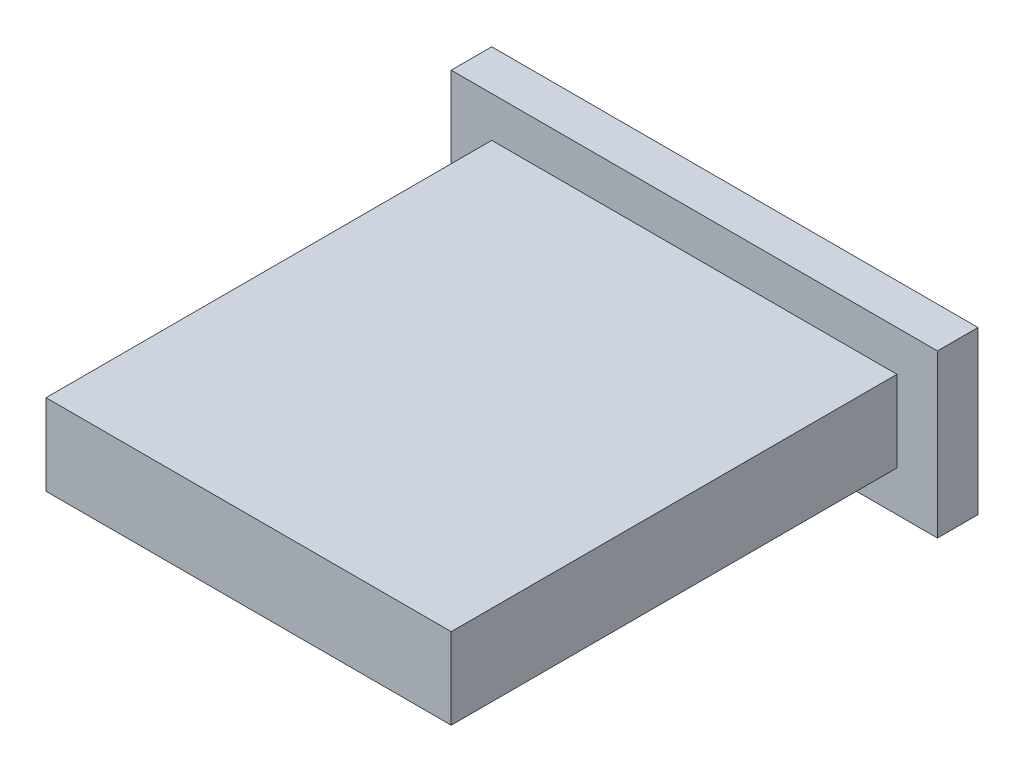
ISO-10303-21;
HEADER;
FILE_DESCRIPTION(('STEP AP214'),'2;1');
FILE_NAME('part.step','',(''),(''),'','','');
FILE_SCHEMA(('AUTOMOTIVE_DESIGN { 1 0 10303 214 1 1 1 1 }'));
ENDSEC;
DATA;
#1=APPLICATION_CONTEXT('core data for automotive mechanical design processes');
#2=APPLICATION_PROTOCOL_DEFINITION('international standard','automotive_design',2000,#1);
#3=PRODUCT_CONTEXT('',#1,'mechanical');
#4=PRODUCT('Part','Part','',(#3));
#5=PRODUCT_RELATED_PRODUCT_CATEGORY('part','',(#4));
#6=PRODUCT_DEFINITION_FORMATION('','',#4);
#7=PRODUCT_DEFINITION_CONTEXT('part definition',#1,'design');
#8=PRODUCT_DEFINITION('design','',#6,#7);
#9=PRODUCT_DEFINITION_SHAPE('','',#8);
#10=(LENGTH_UNIT() NAMED_UNIT(*) SI_UNIT(.MILLI.,.METRE.));
#11=(NAMED_UNIT(*) PLANE_ANGLE_UNIT() SI_UNIT($,.RADIAN.));
#12=(NAMED_UNIT(*) SI_UNIT($,.STERADIAN.) SOLID_ANGLE_UNIT());
#13=UNCERTAINTY_MEASURE_WITH_UNIT(LENGTH_MEASURE(1.E-05),#10,'distance_accuracy_value','');
#14=(GEOMETRIC_REPRESENTATION_CONTEXT(3) GLOBAL_UNCERTAINTY_ASSIGNED_CONTEXT((#13)) GLOBAL_UNIT_ASSIGNED_CONTEXT((#10,
#11,#12)) REPRESENTATION_CONTEXT('',''));
#15=CARTESIAN_POINT('',(0.,0.,0.));
#16=DIRECTION('',(0.,0.,1.));
#17=DIRECTION('',(1.,0.,0.));
#18=AXIS2_PLACEMENT_3D('',#15,#16,#17);
#19=CARTESIAN_POINT('',(-6.,2.,-1.));
#20=DIRECTION('',(-1.,0.,0.));
#21=DIRECTION('',(0.,-1.,0.));
#22=AXIS2_PLACEMENT_3D('',#19,#20,#21);
#23=PLANE('',#22);
#24=DIRECTION('',(0.,-1.,0.));
#25=VECTOR('',#24,1.);
#26=CARTESIAN_POINT('',(-6.,2.,0.));
#27=LINE('',#26,#25);
#28=CARTESIAN_POINT('',(-6.,2.,0.));
#29=VERTEX_POINT('',#28);
#30=CARTESIAN_POINT('',(-6.,-2.,0.));
#31=VERTEX_POINT('',#30);
#32=EDGE_CURVE('E153',#29,#31,#27,.T.);
#33=ORIENTED_EDGE('',*,*,#32,.F.);
#34=DIRECTION('',(0.,0.,1.));
#35=VECTOR('',#34,1.);
#36=CARTESIAN_POINT('',(-6.,2.,-1.));
#37=LINE('',#36,#35);
#38=CARTESIAN_POINT('',(-6.,2.,-1.));
#39=VERTEX_POINT('',#38);
#40=EDGE_CURVE('E12',#39,#29,#37,.T.);
#41=ORIENTED_EDGE('',*,*,#40,.F.);
#42=DIRECTION('',(0.,-1.,0.));
#43=VECTOR('',#42,1.);
#44=CARTESIAN_POINT('',(-6.,2.,-1.));
#45=LINE('',#44,#43);
#46=CARTESIAN_POINT('',(-6.,-2.,-1.));
#47=VERTEX_POINT('',#46);
#48=EDGE_CURVE('E157',#39,#47,#45,.T.);
#49=ORIENTED_EDGE('',*,*,#48,.T.);
#50=DIRECTION('',(0.,0.,1.));
#51=VECTOR('',#50,1.);
#52=CARTESIAN_POINT('',(-6.,-2.,-1.));
#53=LINE('',#52,#51);
#54=EDGE_CURVE('E58',#47,#31,#53,.T.);
#55=ORIENTED_EDGE('',*,*,#54,.T.);
#56=EDGE_LOOP('',(#33,#41,#49,#55));
#57=FACE_BOUND('',#56,.T.);
#58=ADVANCED_FACE('F55',(#57),#23,.T.);
#59=CARTESIAN_POINT('',(-6.,2.,-1.));
#60=DIRECTION('',(0.,1.,0.));
#61=DIRECTION('',(0.,0.,1.));
#62=AXIS2_PLACEMENT_3D('',#59,#60,#61);
#63=PLANE('',#62);
#64=DIRECTION('',(-1.,0.,0.));
#65=VECTOR('',#64,1.);
#66=CARTESIAN_POINT('',(-6.,2.,0.));
#67=LINE('',#66,#65);
#68=CARTESIAN_POINT('',(6.,2.,0.));
#69=VERTEX_POINT('',#68);
#70=EDGE_CURVE('E161',#69,#29,#67,.T.);
#71=ORIENTED_EDGE('',*,*,#70,.F.);
#72=DIRECTION('',(0.,0.,1.));
#73=VECTOR('',#72,1.);
#74=CARTESIAN_POINT('',(6.,2.,-1.));
#75=LINE('',#74,#73);
#76=CARTESIAN_POINT('',(6.,2.,-1.));
#77=VERTEX_POINT('',#76);
#78=EDGE_CURVE('E63',#77,#69,#75,.T.);
#79=ORIENTED_EDGE('',*,*,#78,.F.);
#80=DIRECTION('',(-1.,0.,0.));
#81=VECTOR('',#80,1.);
#82=CARTESIAN_POINT('',(-6.,2.,-1.));
#83=LINE('',#82,#81);
#84=EDGE_CURVE('E167',#77,#39,#83,.T.);
#85=ORIENTED_EDGE('',*,*,#84,.T.);
#86=ORIENTED_EDGE('',*,*,#40,.T.);
#87=EDGE_LOOP('',(#71,#79,#85,#86));
#88=FACE_BOUND('',#87,.T.);
#89=ADVANCED_FACE('F193',(#88),#63,.T.);
#90=CARTESIAN_POINT('',(6.,2.,-1.));
#91=DIRECTION('',(1.,0.,0.));
#92=DIRECTION('',(0.,1.,0.));
#93=AXIS2_PLACEMENT_3D('',#90,#91,#92);
#94=PLANE('',#93);
#95=DIRECTION('',(0.,1.,0.));
#96=VECTOR('',#95,1.);
#97=CARTESIAN_POINT('',(6.,2.,0.));
#98=LINE('',#97,#96);
#99=CARTESIAN_POINT('',(6.,-2.,0.));
#100=VERTEX_POINT('',#99);
#101=EDGE_CURVE('E175',#100,#69,#98,.T.);
#102=ORIENTED_EDGE('',*,*,#101,.F.);
#103=DIRECTION('',(0.,0.,1.));
#104=VECTOR('',#103,1.);
#105=CARTESIAN_POINT('',(6.,-2.,-1.));
#106=LINE('',#105,#104);
#107=CARTESIAN_POINT('',(6.,-2.,-1.));
#108=VERTEX_POINT('',#107);
#109=EDGE_CURVE('E180',#108,#100,#106,.T.);
#110=ORIENTED_EDGE('',*,*,#109,.F.);
#111=DIRECTION('',(0.,1.,0.));
#112=VECTOR('',#111,1.);
#113=CARTESIAN_POINT('',(6.,2.,-1.));
#114=LINE('',#113,#112);
#115=EDGE_CURVE('E164',#108,#77,#114,.T.);
#116=ORIENTED_EDGE('',*,*,#115,.T.);
#117=ORIENTED_EDGE('',*,*,#78,.T.);
#118=EDGE_LOOP('',(#102,#110,#116,#117));
#119=FACE_BOUND('',#118,.T.);
#120=ADVANCED_FACE('F197',(#119),#94,.T.);
#121=CARTESIAN_POINT('',(-6.,-2.,-1.));
#122=DIRECTION('',(0.,-1.,0.));
#123=DIRECTION('',(0.,0.,-1.));
#124=AXIS2_PLACEMENT_3D('',#121,#122,#123);
#125=PLANE('',#124);
#126=DIRECTION('',(1.,0.,0.));
#127=VECTOR('',#126,1.);
#128=CARTESIAN_POINT('',(-6.,-2.,0.));
#129=LINE('',#128,#127);
#130=EDGE_CURVE('E172',#31,#100,#129,.T.);
#131=ORIENTED_EDGE('',*,*,#130,.F.);
#132=ORIENTED_EDGE('',*,*,#54,.F.);
#133=DIRECTION('',(1.,0.,0.));
#134=VECTOR('',#133,1.);
#135=CARTESIAN_POINT('',(-6.,-2.,-1.));
#136=LINE('',#135,#134);
#137=EDGE_CURVE('E160',#47,#108,#136,.T.);
#138=ORIENTED_EDGE('',*,*,#137,.T.);
#139=ORIENTED_EDGE('',*,*,#109,.T.);
#140=EDGE_LOOP('',(#131,#132,#138,#139));
#141=FACE_BOUND('',#140,.T.);
#142=ADVANCED_FACE('F188',(#141),#125,.T.);
#143=CARTESIAN_POINT('',(0.,0.,-1.));
#144=DIRECTION('',(0.,0.,1.));
#145=DIRECTION('',(1.,0.,0.));
#146=AXIS2_PLACEMENT_3D('',#143,#144,#145);
#147=PLANE('',#146);
#148=DIRECTION('',(-1.,0.,0.));
#149=VECTOR('',#148,1.);
#150=CARTESIAN_POINT('',(-5.,1.,-1.));
#151=LINE('',#150,#149);
#152=CARTESIAN_POINT('',(5.,1.,-1.));
#153=VERTEX_POINT('',#152);
#154=CARTESIAN_POINT('',(-5.,1.,-1.));
#155=VERTEX_POINT('',#154);
#156=EDGE_CURVE('E128',#153,#155,#151,.T.);
#157=ORIENTED_EDGE('',*,*,#156,.T.);
#158=DIRECTION('',(0.,-1.,0.));
#159=VECTOR('',#158,1.);
#160=CARTESIAN_POINT('',(-5.,1.,-1.));
#161=LINE('',#160,#159);
#162=CARTESIAN_POINT('',(-5.,-1.,-1.));
#163=VERTEX_POINT('',#162);
#164=EDGE_CURVE('E122',#155,#163,#161,.T.);
#165=ORIENTED_EDGE('',*,*,#164,.T.);
#166=DIRECTION('',(1.,0.,0.));
#167=VECTOR('',#166,1.);
#168=CARTESIAN_POINT('',(-5.,-1.,-1.));
#169=LINE('',#168,#167);
#170=CARTESIAN_POINT('',(5.,-1.,-1.));
#171=VERTEX_POINT('',#170);
#172=EDGE_CURVE('E131',#163,#171,#169,.T.);
#173=ORIENTED_EDGE('',*,*,#172,.T.);
#174=DIRECTION('',(0.,1.,0.));
#175=VECTOR('',#174,1.);
#176=CARTESIAN_POINT('',(5.,1.,-1.));
#177=LINE('',#176,#175);
#178=EDGE_CURVE('E71',#171,#153,#177,.T.);
#179=ORIENTED_EDGE('',*,*,#178,.T.);
#180=EDGE_LOOP('',(#157,#165,#173,#179));
#181=FACE_BOUND('',#180,.T.);
#182=ORIENTED_EDGE('',*,*,#48,.F.);
#183=ORIENTED_EDGE('',*,*,#84,.F.);
#184=ORIENTED_EDGE('',*,*,#115,.F.);
#185=ORIENTED_EDGE('',*,*,#137,.F.);
#186=EDGE_LOOP('',(#182,#183,#184,#185));
#187=FACE_BOUND('',#186,.T.);
#188=ADVANCED_FACE('F135',(#181,#187),#147,.F.);
#189=CARTESIAN_POINT('',(0.,0.,0.));
#190=DIRECTION('',(0.,0.,1.));
#191=DIRECTION('',(1.,0.,0.));
#192=AXIS2_PLACEMENT_3D('',#189,#190,#191);
#193=PLANE('',#192);
#194=DIRECTION('',(0.,-1.,0.));
#195=VECTOR('',#194,1.);
#196=CARTESIAN_POINT('',(-5.,1.,0.));
#197=LINE('',#196,#195);
#198=CARTESIAN_POINT('',(-5.,1.,0.));
#199=VERTEX_POINT('',#198);
#200=CARTESIAN_POINT('',(-5.,-1.,0.));
#201=VERTEX_POINT('',#200);
#202=EDGE_CURVE('E79',#199,#201,#197,.T.);
#203=ORIENTED_EDGE('',*,*,#202,.F.);
#204=DIRECTION('',(-1.,0.,0.));
#205=VECTOR('',#204,1.);
#206=CARTESIAN_POINT('',(-5.,1.,0.));
#207=LINE('',#206,#205);
#208=CARTESIAN_POINT('',(5.,1.,0.));
#209=VERTEX_POINT('',#208);
#210=EDGE_CURVE('E138',#209,#199,#207,.T.);
#211=ORIENTED_EDGE('',*,*,#210,.F.);
#212=DIRECTION('',(0.,1.,0.));
#213=VECTOR('',#212,1.);
#214=CARTESIAN_POINT('',(5.,1.,0.));
#215=LINE('',#214,#213);
#216=CARTESIAN_POINT('',(5.,-1.,0.));
#217=VERTEX_POINT('',#216);
#218=EDGE_CURVE('E141',#217,#209,#215,.T.);
#219=ORIENTED_EDGE('',*,*,#218,.F.);
#220=DIRECTION('',(1.,0.,0.));
#221=VECTOR('',#220,1.);
#222=CARTESIAN_POINT('',(-5.,-1.,0.));
#223=LINE('',#222,#221);
#224=EDGE_CURVE('E147',#201,#217,#223,.T.);
#225=ORIENTED_EDGE('',*,*,#224,.F.);
#226=EDGE_LOOP('',(#203,#211,#219,#225));
#227=FACE_BOUND('',#226,.T.);
#228=ORIENTED_EDGE('',*,*,#32,.T.);
#229=ORIENTED_EDGE('',*,*,#130,.T.);
#230=ORIENTED_EDGE('',*,*,#101,.T.);
#231=ORIENTED_EDGE('',*,*,#70,.T.);
#232=EDGE_LOOP('',(#228,#229,#230,#231));
#233=FACE_BOUND('',#232,.T.);
#234=ADVANCED_FACE('F190',(#227,#233),#193,.T.);
#235=CARTESIAN_POINT('',(-5.,1.,-1.));
#236=DIRECTION('',(-1.,0.,0.));
#237=DIRECTION('',(0.,0.,1.));
#238=AXIS2_PLACEMENT_3D('',#235,#236,#237);
#239=PLANE('',#238);
#240=ORIENTED_EDGE('',*,*,#202,.T.);
#241=DIRECTION('',(0.,0.,1.));
#242=VECTOR('',#241,1.);
#243=CARTESIAN_POINT('',(-5.,-1.,-1.));
#244=LINE('',#243,#242);
#245=EDGE_CURVE('E118',#163,#201,#244,.T.);
#246=ORIENTED_EDGE('',*,*,#245,.F.);
#247=ORIENTED_EDGE('',*,*,#164,.F.);
#248=DIRECTION('',(0.,0.,1.));
#249=VECTOR('',#248,1.);
#250=CARTESIAN_POINT('',(-5.,1.,-1.));
#251=LINE('',#250,#249);
#252=EDGE_CURVE('E151',#155,#199,#251,.T.);
#253=ORIENTED_EDGE('',*,*,#252,.T.);
#254=EDGE_LOOP('',(#240,#246,#247,#253));
#255=FACE_BOUND('',#254,.T.);
#256=ADVANCED_FACE('F120',(#255),#239,.F.);
#257=CARTESIAN_POINT('',(-5.,1.,-1.));
#258=DIRECTION('',(0.,1.,0.));
#259=DIRECTION('',(0.,0.,1.));
#260=AXIS2_PLACEMENT_3D('',#257,#258,#259);
#261=PLANE('',#260);
#262=ORIENTED_EDGE('',*,*,#210,.T.);
#263=ORIENTED_EDGE('',*,*,#252,.F.);
#264=ORIENTED_EDGE('',*,*,#156,.F.);
#265=DIRECTION('',(0.,0.,1.));
#266=VECTOR('',#265,1.);
#267=CARTESIAN_POINT('',(5.,1.,-1.));
#268=LINE('',#267,#266);
#269=EDGE_CURVE('E154',#153,#209,#268,.T.);
#270=ORIENTED_EDGE('',*,*,#269,.T.);
#271=EDGE_LOOP('',(#262,#263,#264,#270));
#272=FACE_BOUND('',#271,.T.);
#273=ADVANCED_FACE('F250',(#272),#261,.F.);
#274=CARTESIAN_POINT('',(5.,1.,-1.));
#275=DIRECTION('',(1.,0.,0.));
#276=DIRECTION('',(0.,0.,-1.));
#277=AXIS2_PLACEMENT_3D('',#274,#275,#276);
#278=PLANE('',#277);
#279=ORIENTED_EDGE('',*,*,#218,.T.);
#280=ORIENTED_EDGE('',*,*,#269,.F.);
#281=ORIENTED_EDGE('',*,*,#178,.F.);
#282=DIRECTION('',(0.,0.,1.));
#283=VECTOR('',#282,1.);
#284=CARTESIAN_POINT('',(5.,-1.,-1.));
#285=LINE('',#284,#283);
#286=EDGE_CURVE('E127',#171,#217,#285,.T.);
#287=ORIENTED_EDGE('',*,*,#286,.T.);
#288=EDGE_LOOP('',(#279,#280,#281,#287));
#289=FACE_BOUND('',#288,.T.);
#290=ADVANCED_FACE('F259',(#289),#278,.F.);
#291=CARTESIAN_POINT('',(-5.,-1.,-1.));
#292=DIRECTION('',(0.,-1.,0.));
#293=DIRECTION('',(0.,0.,-1.));
#294=AXIS2_PLACEMENT_3D('',#291,#292,#293);
#295=PLANE('',#294);
#296=ORIENTED_EDGE('',*,*,#224,.T.);
#297=ORIENTED_EDGE('',*,*,#286,.F.);
#298=ORIENTED_EDGE('',*,*,#172,.F.);
#299=ORIENTED_EDGE('',*,*,#245,.T.);
#300=EDGE_LOOP('',(#296,#297,#298,#299));
#301=FACE_BOUND('',#300,.T.);
#302=ADVANCED_FACE('F132',(#301),#295,.F.);
#303=CLOSED_SHELL('',(#58,#89,#120,#142,#188,#234,#256,#273,#290,#302));
#304=MANIFOLD_SOLID_BREP('B2',#303);
#305=CARTESIAN_POINT('',(-5.,1.,11.));
#306=DIRECTION('',(1.,0.,0.));
#307=DIRECTION('',(0.,0.,-1.));
#308=AXIS2_PLACEMENT_3D('',#305,#306,#307);
#309=PLANE('',#308);
#310=DIRECTION('',(0.,-1.,0.));
#311=VECTOR('',#310,1.);
#312=CARTESIAN_POINT('',(-5.,1.,0.));
#313=LINE('',#312,#311);
#314=CARTESIAN_POINT('',(-5.,1.,0.));
#315=VERTEX_POINT('',#314);
#316=CARTESIAN_POINT('',(-5.,-1.,0.));
#317=VERTEX_POINT('',#316);
#318=EDGE_CURVE('E353',#315,#317,#313,.T.);
#319=ORIENTED_EDGE('',*,*,#318,.T.);
#320=DIRECTION('',(0.,0.,-1.));
#321=VECTOR('',#320,1.);
#322=CARTESIAN_POINT('',(-5.,-1.,11.));
#323=LINE('',#322,#321);
#324=CARTESIAN_POINT('',(-5.,-1.,11.));
#325=VERTEX_POINT('',#324);
#326=EDGE_CURVE('E53',#325,#317,#323,.T.);
#327=ORIENTED_EDGE('',*,*,#326,.F.);
#328=DIRECTION('',(0.,-1.,0.));
#329=VECTOR('',#328,1.);
#330=CARTESIAN_POINT('',(-5.,1.,11.));
#331=LINE('',#330,#329);
#332=CARTESIAN_POINT('',(-5.,1.,11.));
#333=VERTEX_POINT('',#332);
#334=EDGE_CURVE('E335',#333,#325,#331,.T.);
#335=ORIENTED_EDGE('',*,*,#334,.F.);
#336=DIRECTION('',(0.,0.,-1.));
#337=VECTOR('',#336,1.);
#338=CARTESIAN_POINT('',(-5.,1.,11.));
#339=LINE('',#338,#337);
#340=EDGE_CURVE('E302',#333,#315,#339,.T.);
#341=ORIENTED_EDGE('',*,*,#340,.T.);
#342=EDGE_LOOP('',(#319,#327,#335,#341));
#343=FACE_BOUND('',#342,.T.);
#344=ADVANCED_FACE('F285',(#343),#309,.F.);
#345=CARTESIAN_POINT('',(-5.,-1.,11.));
#346=DIRECTION('',(0.,1.,0.));
#347=DIRECTION('',(0.,0.,1.));
#348=AXIS2_PLACEMENT_3D('',#345,#346,#347);
#349=PLANE('',#348);
#350=DIRECTION('',(1.,0.,0.));
#351=VECTOR('',#350,1.);
#352=CARTESIAN_POINT('',(-5.,-1.,0.));
#353=LINE('',#352,#351);
#354=CARTESIAN_POINT('',(5.,-1.,0.));
#355=VERTEX_POINT('',#354);
#356=EDGE_CURVE('E341',#317,#355,#353,.T.);
#357=ORIENTED_EDGE('',*,*,#356,.T.);
#358=DIRECTION('',(0.,0.,-1.));
#359=VECTOR('',#358,1.);
#360=CARTESIAN_POINT('',(5.,-1.,11.));
#361=LINE('',#360,#359);
#362=CARTESIAN_POINT('',(5.,-1.,11.));
#363=VERTEX_POINT('',#362);
#364=EDGE_CURVE('E294',#363,#355,#361,.T.);
#365=ORIENTED_EDGE('',*,*,#364,.F.);
#366=DIRECTION('',(1.,0.,0.));
#367=VECTOR('',#366,1.);
#368=CARTESIAN_POINT('',(-5.,-1.,11.));
#369=LINE('',#368,#367);
#370=EDGE_CURVE('E327',#325,#363,#369,.T.);
#371=ORIENTED_EDGE('',*,*,#370,.F.);
#372=ORIENTED_EDGE('',*,*,#326,.T.);
#373=EDGE_LOOP('',(#357,#365,#371,#372));
#374=FACE_BOUND('',#373,.T.);
#375=ADVANCED_FACE('F340',(#374),#349,.F.);
#376=CARTESIAN_POINT('',(5.,1.,11.));
#377=DIRECTION('',(1.,0.,0.));
#378=DIRECTION('',(0.,0.,-1.));
#379=AXIS2_PLACEMENT_3D('',#376,#377,#378);
#380=PLANE('',#379);
#381=DIRECTION('',(0.,-1.,0.));
#382=VECTOR('',#381,1.);
#383=CARTESIAN_POINT('',(5.,1.,0.));
#384=LINE('',#383,#382);
#385=CARTESIAN_POINT('',(5.,1.,0.));
#386=VERTEX_POINT('',#385);
#387=EDGE_CURVE('E358',#386,#355,#384,.T.);
#388=ORIENTED_EDGE('',*,*,#387,.F.);
#389=DIRECTION('',(0.,0.,-1.));
#390=VECTOR('',#389,1.);
#391=CARTESIAN_POINT('',(5.,1.,11.));
#392=LINE('',#391,#390);
#393=CARTESIAN_POINT('',(5.,1.,11.));
#394=VERTEX_POINT('',#393);
#395=EDGE_CURVE('E316',#394,#386,#392,.T.);
#396=ORIENTED_EDGE('',*,*,#395,.F.);
#397=DIRECTION('',(0.,-1.,0.));
#398=VECTOR('',#397,1.);
#399=CARTESIAN_POINT('',(5.,1.,11.));
#400=LINE('',#399,#398);
#401=EDGE_CURVE('E334',#394,#363,#400,.T.);
#402=ORIENTED_EDGE('',*,*,#401,.T.);
#403=ORIENTED_EDGE('',*,*,#364,.T.);
#404=EDGE_LOOP('',(#388,#396,#402,#403));
#405=FACE_BOUND('',#404,.T.);
#406=ADVANCED_FACE('F345',(#405),#380,.T.);
#407=CARTESIAN_POINT('',(-5.,1.,11.));
#408=DIRECTION('',(0.,1.,0.));
#409=DIRECTION('',(0.,0.,1.));
#410=AXIS2_PLACEMENT_3D('',#407,#408,#409);
#411=PLANE('',#410);
#412=DIRECTION('',(1.,0.,0.));
#413=VECTOR('',#412,1.);
#414=CARTESIAN_POINT('',(-5.,1.,0.));
#415=LINE('',#414,#413);
#416=EDGE_CURVE('E361',#315,#386,#415,.T.);
#417=ORIENTED_EDGE('',*,*,#416,.F.);
#418=ORIENTED_EDGE('',*,*,#340,.F.);
#419=DIRECTION('',(1.,0.,0.));
#420=VECTOR('',#419,1.);
#421=CARTESIAN_POINT('',(-5.,1.,11.));
#422=LINE('',#421,#420);
#423=EDGE_CURVE('E347',#333,#394,#422,.T.);
#424=ORIENTED_EDGE('',*,*,#423,.T.);
#425=ORIENTED_EDGE('',*,*,#395,.T.);
#426=EDGE_LOOP('',(#417,#418,#424,#425));
#427=FACE_BOUND('',#426,.T.);
#428=ADVANCED_FACE('F371',(#427),#411,.T.);
#429=CARTESIAN_POINT('',(0.,0.,11.));
#430=DIRECTION('',(0.,0.,1.));
#431=DIRECTION('',(1.,0.,0.));
#432=AXIS2_PLACEMENT_3D('',#429,#430,#431);
#433=PLANE('',#432);
#434=ORIENTED_EDGE('',*,*,#334,.T.);
#435=ORIENTED_EDGE('',*,*,#370,.T.);
#436=ORIENTED_EDGE('',*,*,#401,.F.);
#437=ORIENTED_EDGE('',*,*,#423,.F.);
#438=EDGE_LOOP('',(#434,#435,#436,#437));
#439=FACE_BOUND('',#438,.T.);
#440=ADVANCED_FACE('F331',(#439),#433,.T.);
#441=CARTESIAN_POINT('',(0.,0.,0.));
#442=DIRECTION('',(0.,0.,1.));
#443=DIRECTION('',(1.,0.,0.));
#444=AXIS2_PLACEMENT_3D('',#441,#442,#443);
#445=PLANE('',#444);
#446=ORIENTED_EDGE('',*,*,#318,.F.);
#447=ORIENTED_EDGE('',*,*,#416,.T.);
#448=ORIENTED_EDGE('',*,*,#387,.T.);
#449=ORIENTED_EDGE('',*,*,#356,.F.);
#450=EDGE_LOOP('',(#446,#447,#448,#449));
#451=FACE_BOUND('',#450,.T.);
#452=ADVANCED_FACE('F370',(#451),#445,.F.);
#453=CLOSED_SHELL('',(#344,#375,#406,#428,#440,#452));
#454=MANIFOLD_SOLID_BREP('B6',#453);
#455=ADVANCED_BREP_SHAPE_REPRESENTATION('',(#18,#304,#454),#14);
#456=SHAPE_DEFINITION_REPRESENTATION(#9,#455);
ENDSEC;
END-ISO-10303-21;
